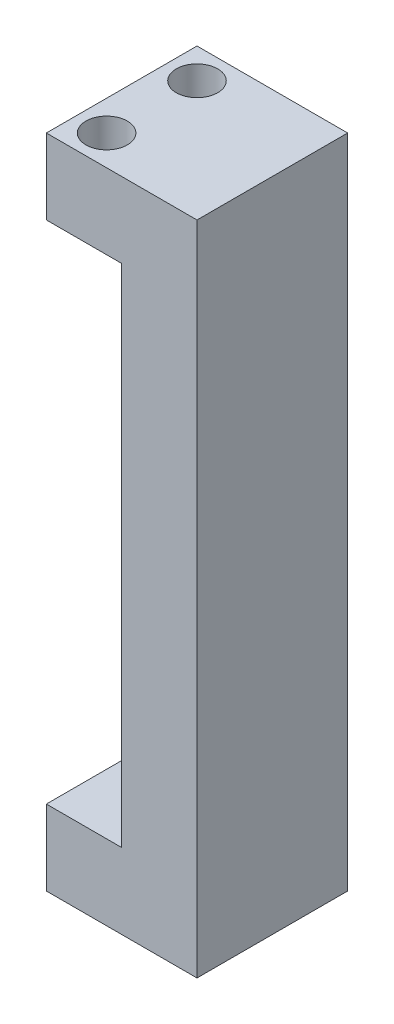
ISO-10303-21;
HEADER;
FILE_DESCRIPTION(('STEP AP214'),'2;1');
FILE_NAME('part.step','',(''),(''),'','','');
FILE_SCHEMA(('AUTOMOTIVE_DESIGN { 1 0 10303 214 1 1 1 1 }'));
ENDSEC;
DATA;
#1=APPLICATION_CONTEXT('core data for automotive mechanical design processes');
#2=APPLICATION_PROTOCOL_DEFINITION('international standard','automotive_design',2000,#1);
#3=PRODUCT_CONTEXT('',#1,'mechanical');
#4=PRODUCT('Part','Part','',(#3));
#5=PRODUCT_RELATED_PRODUCT_CATEGORY('part','',(#4));
#6=PRODUCT_DEFINITION_FORMATION('','',#4);
#7=PRODUCT_DEFINITION_CONTEXT('part definition',#1,'design');
#8=PRODUCT_DEFINITION('design','',#6,#7);
#9=PRODUCT_DEFINITION_SHAPE('','',#8);
#10=(LENGTH_UNIT() NAMED_UNIT(*) SI_UNIT(.MILLI.,.METRE.));
#11=(NAMED_UNIT(*) PLANE_ANGLE_UNIT() SI_UNIT($,.RADIAN.));
#12=(NAMED_UNIT(*) SI_UNIT($,.STERADIAN.) SOLID_ANGLE_UNIT());
#13=UNCERTAINTY_MEASURE_WITH_UNIT(LENGTH_MEASURE(1.E-05),#10,'distance_accuracy_value','');
#14=(GEOMETRIC_REPRESENTATION_CONTEXT(3) GLOBAL_UNCERTAINTY_ASSIGNED_CONTEXT((#13)) GLOBAL_UNIT_ASSIGNED_CONTEXT((#10,
#11,#12)) REPRESENTATION_CONTEXT('',''));
#15=CARTESIAN_POINT('',(0.,0.,0.));
#16=DIRECTION('',(0.,0.,1.));
#17=DIRECTION('',(1.,0.,0.));
#18=AXIS2_PLACEMENT_3D('',#15,#16,#17);
#19=CARTESIAN_POINT('',(-20.,30.1500000000001,20.));
#20=DIRECTION('',(1.,0.,0.));
#21=DIRECTION('',(0.,0.,-1.));
#22=AXIS2_PLACEMENT_3D('',#19,#20,#21);
#23=PLANE('',#22);
#24=DIRECTION('',(0.,-1.,0.));
#25=VECTOR('',#24,1.);
#26=CARTESIAN_POINT('',(-20.,30.1500000000001,20.));
#27=LINE('',#26,#25);
#28=CARTESIAN_POINT('',(-20.,10.,20.));
#29=VERTEX_POINT('',#28);
#30=CARTESIAN_POINT('',(-20.,0.,20.));
#31=VERTEX_POINT('',#30);
#32=EDGE_CURVE('E91',#29,#31,#27,.T.);
#33=ORIENTED_EDGE('',*,*,#32,.F.);
#34=DIRECTION('',(0.,0.,1.));
#35=VECTOR('',#34,1.);
#36=CARTESIAN_POINT('',(-20.,10.,0.));
#37=LINE('',#36,#35);
#38=CARTESIAN_POINT('',(-20.,10.,0.));
#39=VERTEX_POINT('',#38);
#40=EDGE_CURVE('E212',#39,#29,#37,.T.);
#41=ORIENTED_EDGE('',*,*,#40,.F.);
#42=DIRECTION('',(0.,-1.,0.));
#43=VECTOR('',#42,1.);
#44=CARTESIAN_POINT('',(-20.,30.1500000000001,0.));
#45=LINE('',#44,#43);
#46=CARTESIAN_POINT('',(-20.,0.,0.));
#47=VERTEX_POINT('',#46);
#48=EDGE_CURVE('E127',#39,#47,#45,.T.);
#49=ORIENTED_EDGE('',*,*,#48,.T.);
#50=DIRECTION('',(0.,0.,-1.));
#51=VECTOR('',#50,1.);
#52=CARTESIAN_POINT('',(-20.,0.,20.));
#53=LINE('',#52,#51);
#54=EDGE_CURVE('E11',#31,#47,#53,.T.);
#55=ORIENTED_EDGE('',*,*,#54,.F.);
#56=EDGE_LOOP('',(#33,#41,#49,#55));
#57=FACE_BOUND('',#56,.T.);
#58=ADVANCED_FACE('F37',(#57),#23,.F.);
#59=CARTESIAN_POINT('',(-20.,0.,20.));
#60=DIRECTION('',(0.,1.,0.));
#61=DIRECTION('',(0.,0.,1.));
#62=AXIS2_PLACEMENT_3D('',#59,#60,#61);
#63=PLANE('',#62);
#64=CARTESIAN_POINT('',(-15.,0.,5.));
#65=DIRECTION('',(0.,-1.,0.));
#66=DIRECTION('',(0.,0.,-1.));
#67=AXIS2_PLACEMENT_3D('',#64,#65,#66);
#68=CIRCLE('',#67,1.64999999999999);
#69=CARTESIAN_POINT('',(-15.,0.,3.35000000000001));
#70=VERTEX_POINT('',#69);
#71=EDGE_CURVE('E165',#70,#70,#68,.T.);
#72=ORIENTED_EDGE('',*,*,#71,.F.);
#73=EDGE_LOOP('',(#72));
#74=FACE_BOUND('',#73,.T.);
#75=CARTESIAN_POINT('',(-5.00000000000001,0.,5.));
#76=DIRECTION('',(0.,-1.,0.));
#77=DIRECTION('',(0.,0.,-1.));
#78=AXIS2_PLACEMENT_3D('',#75,#76,#77);
#79=CIRCLE('',#78,1.64999999999999);
#80=CARTESIAN_POINT('',(-5.00000000000001,0.,3.35000000000001));
#81=VERTEX_POINT('',#80);
#82=EDGE_CURVE('E175',#81,#81,#79,.T.);
#83=ORIENTED_EDGE('',*,*,#82,.F.);
#84=EDGE_LOOP('',(#83));
#85=FACE_BOUND('',#84,.T.);
#86=CARTESIAN_POINT('',(-15.,0.,15.));
#87=DIRECTION('',(0.,-1.,0.));
#88=DIRECTION('',(0.,0.,-1.));
#89=AXIS2_PLACEMENT_3D('',#86,#87,#88);
#90=CIRCLE('',#89,1.64999999999999);
#91=CARTESIAN_POINT('',(-15.,0.,13.35));
#92=VERTEX_POINT('',#91);
#93=EDGE_CURVE('E181',#92,#92,#90,.T.);
#94=ORIENTED_EDGE('',*,*,#93,.F.);
#95=EDGE_LOOP('',(#94));
#96=FACE_BOUND('',#95,.T.);
#97=CARTESIAN_POINT('',(-5.00000000000001,0.,15.));
#98=DIRECTION('',(0.,-1.,0.));
#99=DIRECTION('',(0.,0.,-1.));
#100=AXIS2_PLACEMENT_3D('',#97,#98,#99);
#101=CIRCLE('',#100,1.64999999999999);
#102=CARTESIAN_POINT('',(-5.00000000000001,0.,13.35));
#103=VERTEX_POINT('',#102);
#104=EDGE_CURVE('E187',#103,#103,#101,.T.);
#105=ORIENTED_EDGE('',*,*,#104,.F.);
#106=EDGE_LOOP('',(#105));
#107=FACE_BOUND('',#106,.T.);
#108=DIRECTION('',(1.,0.,0.));
#109=VECTOR('',#108,1.);
#110=CARTESIAN_POINT('',(-20.,0.,0.));
#111=LINE('',#110,#109);
#112=CARTESIAN_POINT('',(0.,0.,0.));
#113=VERTEX_POINT('',#112);
#114=EDGE_CURVE('E129',#47,#113,#111,.T.);
#115=ORIENTED_EDGE('',*,*,#114,.T.);
#116=DIRECTION('',(0.,0.,-1.));
#117=VECTOR('',#116,1.);
#118=CARTESIAN_POINT('',(0.,0.,20.));
#119=LINE('',#118,#117);
#120=CARTESIAN_POINT('',(0.,0.,20.));
#121=VERTEX_POINT('',#120);
#122=EDGE_CURVE('E44',#121,#113,#119,.T.);
#123=ORIENTED_EDGE('',*,*,#122,.F.);
#124=DIRECTION('',(1.,0.,0.));
#125=VECTOR('',#124,1.);
#126=CARTESIAN_POINT('',(-20.,0.,20.));
#127=LINE('',#126,#125);
#128=EDGE_CURVE('E105',#31,#121,#127,.T.);
#129=ORIENTED_EDGE('',*,*,#128,.F.);
#130=ORIENTED_EDGE('',*,*,#54,.T.);
#131=EDGE_LOOP('',(#115,#123,#129,#130));
#132=FACE_BOUND('',#131,.T.);
#133=ADVANCED_FACE('F203',(#74,#85,#96,#107,#132),#63,.F.);
#134=CARTESIAN_POINT('',(0.,0.,20.));
#135=DIRECTION('',(-1.,0.,0.));
#136=DIRECTION('',(0.,0.,1.));
#137=AXIS2_PLACEMENT_3D('',#134,#135,#136);
#138=PLANE('',#137);
#139=DIRECTION('',(0.,1.,0.));
#140=VECTOR('',#139,1.);
#141=CARTESIAN_POINT('',(0.,0.,0.));
#142=LINE('',#141,#140);
#143=CARTESIAN_POINT('',(0.,87.1500000000001,0.));
#144=VERTEX_POINT('',#143);
#145=EDGE_CURVE('E114',#113,#144,#142,.T.);
#146=ORIENTED_EDGE('',*,*,#145,.T.);
#147=DIRECTION('',(0.,0.,-1.));
#148=VECTOR('',#147,1.);
#149=CARTESIAN_POINT('',(0.,87.1500000000001,20.));
#150=LINE('',#149,#148);
#151=CARTESIAN_POINT('',(0.,87.1500000000001,20.));
#152=VERTEX_POINT('',#151);
#153=EDGE_CURVE('E111',#152,#144,#150,.T.);
#154=ORIENTED_EDGE('',*,*,#153,.F.);
#155=DIRECTION('',(0.,1.,0.));
#156=VECTOR('',#155,1.);
#157=CARTESIAN_POINT('',(0.,0.,20.));
#158=LINE('',#157,#156);
#159=EDGE_CURVE('E98',#121,#152,#158,.T.);
#160=ORIENTED_EDGE('',*,*,#159,.F.);
#161=ORIENTED_EDGE('',*,*,#122,.T.);
#162=EDGE_LOOP('',(#146,#154,#160,#161));
#163=FACE_BOUND('',#162,.T.);
#164=ADVANCED_FACE('F112',(#163),#138,.F.);
#165=CARTESIAN_POINT('',(0.,87.1500000000001,20.));
#166=DIRECTION('',(0.,-1.,0.));
#167=DIRECTION('',(0.,0.,-1.));
#168=AXIS2_PLACEMENT_3D('',#165,#166,#167);
#169=PLANE('',#168);
#170=CARTESIAN_POINT('',(-16.,87.1500000000001,16.));
#171=DIRECTION('',(0.,-1.,0.));
#172=DIRECTION('',(0.,0.,1.));
#173=AXIS2_PLACEMENT_3D('',#170,#171,#172);
#174=CIRCLE('',#173,2.75);
#175=CARTESIAN_POINT('',(-16.,87.1500000000001,18.75));
#176=VERTEX_POINT('',#175);
#177=EDGE_CURVE('E436',#176,#176,#174,.T.);
#178=ORIENTED_EDGE('',*,*,#177,.T.);
#179=EDGE_LOOP('',(#178));
#180=FACE_BOUND('',#179,.T.);
#181=CARTESIAN_POINT('',(-16.,87.1500000000001,4.));
#182=DIRECTION('',(0.,-1.,0.));
#183=DIRECTION('',(0.,0.,-1.));
#184=AXIS2_PLACEMENT_3D('',#181,#182,#183);
#185=CIRCLE('',#184,2.75);
#186=CARTESIAN_POINT('',(-16.,87.1500000000001,1.25));
#187=VERTEX_POINT('',#186);
#188=EDGE_CURVE('E444',#187,#187,#185,.T.);
#189=ORIENTED_EDGE('',*,*,#188,.T.);
#190=EDGE_LOOP('',(#189));
#191=FACE_BOUND('',#190,.T.);
#192=DIRECTION('',(-1.,0.,0.));
#193=VECTOR('',#192,1.);
#194=CARTESIAN_POINT('',(0.,87.1500000000001,0.));
#195=LINE('',#194,#193);
#196=CARTESIAN_POINT('',(-20.,87.1500000000001,0.));
#197=VERTEX_POINT('',#196);
#198=EDGE_CURVE('E133',#144,#197,#195,.T.);
#199=ORIENTED_EDGE('',*,*,#198,.T.);
#200=DIRECTION('',(0.,0.,-1.));
#201=VECTOR('',#200,1.);
#202=CARTESIAN_POINT('',(-20.,87.1500000000001,20.));
#203=LINE('',#202,#201);
#204=CARTESIAN_POINT('',(-20.,87.1500000000001,20.));
#205=VERTEX_POINT('',#204);
#206=EDGE_CURVE('E117',#205,#197,#203,.T.);
#207=ORIENTED_EDGE('',*,*,#206,.F.);
#208=DIRECTION('',(-1.,0.,0.));
#209=VECTOR('',#208,1.);
#210=CARTESIAN_POINT('',(0.,87.1500000000001,20.));
#211=LINE('',#210,#209);
#212=EDGE_CURVE('E103',#152,#205,#211,.T.);
#213=ORIENTED_EDGE('',*,*,#212,.F.);
#214=ORIENTED_EDGE('',*,*,#153,.T.);
#215=EDGE_LOOP('',(#199,#207,#213,#214));
#216=FACE_BOUND('',#215,.T.);
#217=ADVANCED_FACE('F119',(#180,#191,#216),#169,.F.);
#218=CARTESIAN_POINT('',(-20.,87.1500000000001,20.));
#219=DIRECTION('',(1.,0.,0.));
#220=DIRECTION('',(0.,0.,-1.));
#221=AXIS2_PLACEMENT_3D('',#218,#219,#220);
#222=PLANE('',#221);
#223=DIRECTION('',(0.,-1.,0.));
#224=VECTOR('',#223,1.);
#225=CARTESIAN_POINT('',(-20.,87.1500000000001,0.));
#226=LINE('',#225,#224);
#227=CARTESIAN_POINT('',(-20.,77.15,0.));
#228=VERTEX_POINT('',#227);
#229=EDGE_CURVE('E84',#197,#228,#226,.T.);
#230=ORIENTED_EDGE('',*,*,#229,.T.);
#231=DIRECTION('',(0.,0.,-1.));
#232=VECTOR('',#231,1.);
#233=CARTESIAN_POINT('',(-20.,77.15,20.));
#234=LINE('',#233,#232);
#235=CARTESIAN_POINT('',(-20.,77.15,20.));
#236=VERTEX_POINT('',#235);
#237=EDGE_CURVE('E126',#236,#228,#234,.T.);
#238=ORIENTED_EDGE('',*,*,#237,.F.);
#239=DIRECTION('',(0.,-1.,0.));
#240=VECTOR('',#239,1.);
#241=CARTESIAN_POINT('',(-20.,87.1500000000001,20.));
#242=LINE('',#241,#240);
#243=EDGE_CURVE('E60',#205,#236,#242,.T.);
#244=ORIENTED_EDGE('',*,*,#243,.F.);
#245=ORIENTED_EDGE('',*,*,#206,.T.);
#246=EDGE_LOOP('',(#230,#238,#244,#245));
#247=FACE_BOUND('',#246,.T.);
#248=ADVANCED_FACE('F144',(#247),#222,.F.);
#249=CARTESIAN_POINT('',(-15.0000000000001,77.15,20.));
#250=DIRECTION('',(0.,1.,0.));
#251=DIRECTION('',(0.,0.,1.));
#252=AXIS2_PLACEMENT_3D('',#249,#250,#251);
#253=PLANE('',#252);
#254=CARTESIAN_POINT('',(-16.,77.15,16.));
#255=DIRECTION('',(0.,-1.,0.));
#256=DIRECTION('',(0.,0.,1.));
#257=AXIS2_PLACEMENT_3D('',#254,#255,#256);
#258=CIRCLE('',#257,2.75);
#259=CARTESIAN_POINT('',(-16.,77.15,18.75));
#260=VERTEX_POINT('',#259);
#261=EDGE_CURVE('E439',#260,#260,#258,.T.);
#262=ORIENTED_EDGE('',*,*,#261,.F.);
#263=EDGE_LOOP('',(#262));
#264=FACE_BOUND('',#263,.T.);
#265=CARTESIAN_POINT('',(-16.,77.15,4.));
#266=DIRECTION('',(0.,-1.,0.));
#267=DIRECTION('',(0.,0.,-1.));
#268=AXIS2_PLACEMENT_3D('',#265,#266,#267);
#269=CIRCLE('',#268,2.75);
#270=CARTESIAN_POINT('',(-16.,77.15,1.25));
#271=VERTEX_POINT('',#270);
#272=EDGE_CURVE('E441',#271,#271,#269,.T.);
#273=ORIENTED_EDGE('',*,*,#272,.F.);
#274=EDGE_LOOP('',(#273));
#275=FACE_BOUND('',#274,.T.);
#276=DIRECTION('',(1.,0.,0.));
#277=VECTOR('',#276,1.);
#278=CARTESIAN_POINT('',(-15.0000000000001,77.15,0.));
#279=LINE('',#278,#277);
#280=CARTESIAN_POINT('',(-10.0000000000001,77.15,0.));
#281=VERTEX_POINT('',#280);
#282=EDGE_CURVE('E51',#228,#281,#279,.T.);
#283=ORIENTED_EDGE('',*,*,#282,.T.);
#284=DIRECTION('',(0.,0.,-1.));
#285=VECTOR('',#284,1.);
#286=CARTESIAN_POINT('',(-10.0000000000001,77.15,0.));
#287=LINE('',#286,#285);
#288=CARTESIAN_POINT('',(-10.0000000000001,77.15,20.));
#289=VERTEX_POINT('',#288);
#290=EDGE_CURVE('E148',#289,#281,#287,.T.);
#291=ORIENTED_EDGE('',*,*,#290,.F.);
#292=DIRECTION('',(1.,0.,0.));
#293=VECTOR('',#292,1.);
#294=CARTESIAN_POINT('',(-15.0000000000001,77.15,20.));
#295=LINE('',#294,#293);
#296=EDGE_CURVE('E121',#236,#289,#295,.T.);
#297=ORIENTED_EDGE('',*,*,#296,.F.);
#298=ORIENTED_EDGE('',*,*,#237,.T.);
#299=EDGE_LOOP('',(#283,#291,#297,#298));
#300=FACE_BOUND('',#299,.T.);
#301=ADVANCED_FACE('F146',(#264,#275,#300),#253,.F.);
#302=CARTESIAN_POINT('',(0.,0.,20.));
#303=DIRECTION('',(0.,0.,1.));
#304=DIRECTION('',(1.,0.,0.));
#305=AXIS2_PLACEMENT_3D('',#302,#303,#304);
#306=PLANE('',#305);
#307=DIRECTION('',(0.,1.,0.));
#308=VECTOR('',#307,1.);
#309=CARTESIAN_POINT('',(-10.0000000000001,30.1500000000001,20.));
#310=LINE('',#309,#308);
#311=CARTESIAN_POINT('',(-10.0000000000001,10.,20.));
#312=VERTEX_POINT('',#311);
#313=EDGE_CURVE('E151',#312,#289,#310,.T.);
#314=ORIENTED_EDGE('',*,*,#313,.F.);
#315=DIRECTION('',(1.,0.,0.));
#316=VECTOR('',#315,1.);
#317=CARTESIAN_POINT('',(-10.0000000000001,10.,20.));
#318=LINE('',#317,#316);
#319=EDGE_CURVE('E447',#29,#312,#318,.T.);
#320=ORIENTED_EDGE('',*,*,#319,.F.);
#321=ORIENTED_EDGE('',*,*,#32,.T.);
#322=ORIENTED_EDGE('',*,*,#128,.T.);
#323=ORIENTED_EDGE('',*,*,#159,.T.);
#324=ORIENTED_EDGE('',*,*,#212,.T.);
#325=ORIENTED_EDGE('',*,*,#243,.T.);
#326=ORIENTED_EDGE('',*,*,#296,.T.);
#327=EDGE_LOOP('',(#314,#320,#321,#322,#323,#324,#325,#326));
#328=FACE_BOUND('',#327,.T.);
#329=ADVANCED_FACE('F101',(#328),#306,.T.);
#330=CARTESIAN_POINT('',(0.,0.,0.));
#331=DIRECTION('',(0.,0.,1.));
#332=DIRECTION('',(1.,0.,0.));
#333=AXIS2_PLACEMENT_3D('',#330,#331,#332);
#334=PLANE('',#333);
#335=DIRECTION('',(1.,0.,0.));
#336=VECTOR('',#335,1.);
#337=CARTESIAN_POINT('',(-10.0000000000001,10.,0.));
#338=LINE('',#337,#336);
#339=CARTESIAN_POINT('',(-10.0000000000001,10.,0.));
#340=VERTEX_POINT('',#339);
#341=EDGE_CURVE('E214',#39,#340,#338,.T.);
#342=ORIENTED_EDGE('',*,*,#341,.T.);
#343=DIRECTION('',(0.,-1.,0.));
#344=VECTOR('',#343,1.);
#345=CARTESIAN_POINT('',(-10.0000000000001,30.1500000000001,0.));
#346=LINE('',#345,#344);
#347=EDGE_CURVE('E163',#281,#340,#346,.T.);
#348=ORIENTED_EDGE('',*,*,#347,.F.);
#349=ORIENTED_EDGE('',*,*,#282,.F.);
#350=ORIENTED_EDGE('',*,*,#229,.F.);
#351=ORIENTED_EDGE('',*,*,#198,.F.);
#352=ORIENTED_EDGE('',*,*,#145,.F.);
#353=ORIENTED_EDGE('',*,*,#114,.F.);
#354=ORIENTED_EDGE('',*,*,#48,.F.);
#355=EDGE_LOOP('',(#342,#348,#349,#350,#351,#352,#353,#354));
#356=FACE_BOUND('',#355,.T.);
#357=ADVANCED_FACE('F142',(#356),#334,.F.);
#358=CARTESIAN_POINT('',(-5.00000000000001,6.,15.));
#359=DIRECTION('',(0.,-1.,0.));
#360=DIRECTION('',(0.,0.,-1.));
#361=AXIS2_PLACEMENT_3D('',#358,#359,#360);
#362=CONICAL_SURFACE('',#361,1.65,1.02974425867665);
#363=CARTESIAN_POINT('',(-5.00000000000001,6.99142002139547,15.));
#364=VERTEX_POINT('',#363);
#365=VERTEX_LOOP('',#364);
#366=FACE_BOUND('',#365,.T.);
#367=CARTESIAN_POINT('',(-5.00000000000001,6.,15.));
#368=DIRECTION('',(0.,-1.,0.));
#369=DIRECTION('',(0.,0.,-1.));
#370=AXIS2_PLACEMENT_3D('',#367,#368,#369);
#371=CIRCLE('',#370,1.65);
#372=CARTESIAN_POINT('',(-5.00000000000001,6.,13.35));
#373=VERTEX_POINT('',#372);
#374=EDGE_CURVE('E130',#373,#373,#371,.T.);
#375=ORIENTED_EDGE('',*,*,#374,.T.);
#376=EDGE_LOOP('',(#375));
#377=FACE_BOUND('',#376,.T.);
#378=ADVANCED_FACE('F194',(#366,#377),#362,.F.);
#379=CARTESIAN_POINT('',(-5.00000000000001,0.,15.));
#380=DIRECTION('',(0.,-1.,0.));
#381=DIRECTION('',(0.,0.,-1.));
#382=AXIS2_PLACEMENT_3D('',#379,#380,#381);
#383=CYLINDRICAL_SURFACE('',#382,1.64999999999999);
#384=ORIENTED_EDGE('',*,*,#374,.F.);
#385=EDGE_LOOP('',(#384));
#386=FACE_BOUND('',#385,.T.);
#387=ORIENTED_EDGE('',*,*,#104,.T.);
#388=EDGE_LOOP('',(#387));
#389=FACE_BOUND('',#388,.T.);
#390=ADVANCED_FACE('F196',(#386,#389),#383,.F.);
#391=CARTESIAN_POINT('',(-15.,6.,15.));
#392=DIRECTION('',(0.,-1.,0.));
#393=DIRECTION('',(0.,0.,-1.));
#394=AXIS2_PLACEMENT_3D('',#391,#392,#393);
#395=CONICAL_SURFACE('',#394,1.65,1.02974425867665);
#396=CARTESIAN_POINT('',(-15.,6.99142002139547,15.));
#397=VERTEX_POINT('',#396);
#398=VERTEX_LOOP('',#397);
#399=FACE_BOUND('',#398,.T.);
#400=CARTESIAN_POINT('',(-15.,6.,15.));
#401=DIRECTION('',(0.,-1.,0.));
#402=DIRECTION('',(0.,0.,-1.));
#403=AXIS2_PLACEMENT_3D('',#400,#401,#402);
#404=CIRCLE('',#403,1.65);
#405=CARTESIAN_POINT('',(-15.,6.,13.35));
#406=VERTEX_POINT('',#405);
#407=EDGE_CURVE('E184',#406,#406,#404,.T.);
#408=ORIENTED_EDGE('',*,*,#407,.T.);
#409=EDGE_LOOP('',(#408));
#410=FACE_BOUND('',#409,.T.);
#411=ADVANCED_FACE('F199',(#399,#410),#395,.F.);
#412=CARTESIAN_POINT('',(-15.,0.,15.));
#413=DIRECTION('',(0.,-1.,0.));
#414=DIRECTION('',(0.,0.,-1.));
#415=AXIS2_PLACEMENT_3D('',#412,#413,#414);
#416=CYLINDRICAL_SURFACE('',#415,1.64999999999999);
#417=ORIENTED_EDGE('',*,*,#407,.F.);
#418=EDGE_LOOP('',(#417));
#419=FACE_BOUND('',#418,.T.);
#420=ORIENTED_EDGE('',*,*,#93,.T.);
#421=EDGE_LOOP('',(#420));
#422=FACE_BOUND('',#421,.T.);
#423=ADVANCED_FACE('F327',(#419,#422),#416,.F.);
#424=CARTESIAN_POINT('',(-5.00000000000001,6.,5.));
#425=DIRECTION('',(0.,-1.,0.));
#426=DIRECTION('',(0.,0.,-1.));
#427=AXIS2_PLACEMENT_3D('',#424,#425,#426);
#428=CONICAL_SURFACE('',#427,1.65,1.02974425867665);
#429=CARTESIAN_POINT('',(-5.00000000000001,6.99142002139547,5.));
#430=VERTEX_POINT('',#429);
#431=VERTEX_LOOP('',#430);
#432=FACE_BOUND('',#431,.T.);
#433=CARTESIAN_POINT('',(-5.00000000000001,6.,5.));
#434=DIRECTION('',(0.,-1.,0.));
#435=DIRECTION('',(0.,0.,-1.));
#436=AXIS2_PLACEMENT_3D('',#433,#434,#435);
#437=CIRCLE('',#436,1.65);
#438=CARTESIAN_POINT('',(-5.00000000000001,6.,3.35));
#439=VERTEX_POINT('',#438);
#440=EDGE_CURVE('E178',#439,#439,#437,.T.);
#441=ORIENTED_EDGE('',*,*,#440,.T.);
#442=EDGE_LOOP('',(#441));
#443=FACE_BOUND('',#442,.T.);
#444=ADVANCED_FACE('F323',(#432,#443),#428,.F.);
#445=CARTESIAN_POINT('',(-5.00000000000001,0.,5.));
#446=DIRECTION('',(0.,-1.,0.));
#447=DIRECTION('',(0.,0.,-1.));
#448=AXIS2_PLACEMENT_3D('',#445,#446,#447);
#449=CYLINDRICAL_SURFACE('',#448,1.64999999999999);
#450=ORIENTED_EDGE('',*,*,#440,.F.);
#451=EDGE_LOOP('',(#450));
#452=FACE_BOUND('',#451,.T.);
#453=ORIENTED_EDGE('',*,*,#82,.T.);
#454=EDGE_LOOP('',(#453));
#455=FACE_BOUND('',#454,.T.);
#456=ADVANCED_FACE('F319',(#452,#455),#449,.F.);
#457=CARTESIAN_POINT('',(-15.,6.,5.));
#458=DIRECTION('',(0.,-1.,0.));
#459=DIRECTION('',(0.,0.,-1.));
#460=AXIS2_PLACEMENT_3D('',#457,#458,#459);
#461=CONICAL_SURFACE('',#460,1.65,1.02974425867665);
#462=CARTESIAN_POINT('',(-15.,6.99142002139547,5.));
#463=VERTEX_POINT('',#462);
#464=VERTEX_LOOP('',#463);
#465=FACE_BOUND('',#464,.T.);
#466=CARTESIAN_POINT('',(-15.,6.,5.));
#467=DIRECTION('',(0.,-1.,0.));
#468=DIRECTION('',(0.,0.,-1.));
#469=AXIS2_PLACEMENT_3D('',#466,#467,#468);
#470=CIRCLE('',#469,1.65);
#471=CARTESIAN_POINT('',(-15.,6.,3.35));
#472=VERTEX_POINT('',#471);
#473=EDGE_CURVE('E172',#472,#472,#470,.T.);
#474=ORIENTED_EDGE('',*,*,#473,.T.);
#475=EDGE_LOOP('',(#474));
#476=FACE_BOUND('',#475,.T.);
#477=ADVANCED_FACE('F315',(#465,#476),#461,.F.);
#478=CARTESIAN_POINT('',(-15.,0.,5.));
#479=DIRECTION('',(0.,-1.,0.));
#480=DIRECTION('',(0.,0.,-1.));
#481=AXIS2_PLACEMENT_3D('',#478,#479,#480);
#482=CYLINDRICAL_SURFACE('',#481,1.64999999999999);
#483=ORIENTED_EDGE('',*,*,#473,.F.);
#484=EDGE_LOOP('',(#483));
#485=FACE_BOUND('',#484,.T.);
#486=ORIENTED_EDGE('',*,*,#71,.T.);
#487=EDGE_LOOP('',(#486));
#488=FACE_BOUND('',#487,.T.);
#489=ADVANCED_FACE('F265',(#485,#488),#482,.F.);
#490=CARTESIAN_POINT('',(-10.0000000000001,0.,0.));
#491=DIRECTION('',(1.,0.,0.));
#492=DIRECTION('',(0.,0.,-1.));
#493=AXIS2_PLACEMENT_3D('',#490,#491,#492);
#494=PLANE('',#493);
#495=ORIENTED_EDGE('',*,*,#347,.T.);
#496=DIRECTION('',(0.,0.,1.));
#497=VECTOR('',#496,1.);
#498=CARTESIAN_POINT('',(-10.0000000000001,10.,0.));
#499=LINE('',#498,#497);
#500=EDGE_CURVE('E161',#340,#312,#499,.T.);
#501=ORIENTED_EDGE('',*,*,#500,.T.);
#502=ORIENTED_EDGE('',*,*,#313,.T.);
#503=ORIENTED_EDGE('',*,*,#290,.T.);
#504=EDGE_LOOP('',(#495,#501,#502,#503));
#505=FACE_BOUND('',#504,.T.);
#506=ADVANCED_FACE('F158',(#505),#494,.F.);
#507=CARTESIAN_POINT('',(-10.0000000000001,10.,0.));
#508=DIRECTION('',(0.,-1.,0.));
#509=DIRECTION('',(1.,0.,0.));
#510=AXIS2_PLACEMENT_3D('',#507,#508,#509);
#511=PLANE('',#510);
#512=ORIENTED_EDGE('',*,*,#319,.T.);
#513=ORIENTED_EDGE('',*,*,#500,.F.);
#514=ORIENTED_EDGE('',*,*,#341,.F.);
#515=ORIENTED_EDGE('',*,*,#40,.T.);
#516=EDGE_LOOP('',(#512,#513,#514,#515));
#517=FACE_BOUND('',#516,.T.);
#518=ADVANCED_FACE('F264',(#517),#511,.F.);
#519=CARTESIAN_POINT('',(-16.,87.1500000000001,4.));
#520=DIRECTION('',(0.,-1.,0.));
#521=DIRECTION('',(0.,0.,-1.));
#522=AXIS2_PLACEMENT_3D('',#519,#520,#521);
#523=CYLINDRICAL_SURFACE('',#522,2.75);
#524=ORIENTED_EDGE('',*,*,#188,.F.);
#525=EDGE_LOOP('',(#524));
#526=FACE_BOUND('',#525,.T.);
#527=ORIENTED_EDGE('',*,*,#272,.T.);
#528=EDGE_LOOP('',(#527));
#529=FACE_BOUND('',#528,.T.);
#530=ADVANCED_FACE('F276',(#526,#529),#523,.F.);
#531=CARTESIAN_POINT('',(-16.,87.1500000000001,16.));
#532=DIRECTION('',(0.,-1.,0.));
#533=DIRECTION('',(0.,0.,-1.));
#534=AXIS2_PLACEMENT_3D('',#531,#532,#533);
#535=CYLINDRICAL_SURFACE('',#534,2.75);
#536=ORIENTED_EDGE('',*,*,#177,.F.);
#537=EDGE_LOOP('',(#536));
#538=FACE_BOUND('',#537,.T.);
#539=ORIENTED_EDGE('',*,*,#261,.T.);
#540=EDGE_LOOP('',(#539));
#541=FACE_BOUND('',#540,.T.);
#542=ADVANCED_FACE('F297',(#538,#541),#535,.F.);
#543=CLOSED_SHELL('',(#58,#133,#164,#217,#248,#301,#329,#357,#378,#390,#411,#423,#444,#456,#477,
#489,#506,#518,#530,#542));
#544=MANIFOLD_SOLID_BREP('B2',#543);
#545=ADVANCED_BREP_SHAPE_REPRESENTATION('',(#18,#544),#14);
#546=SHAPE_DEFINITION_REPRESENTATION(#9,#545);
ENDSEC;
END-ISO-10303-21;
